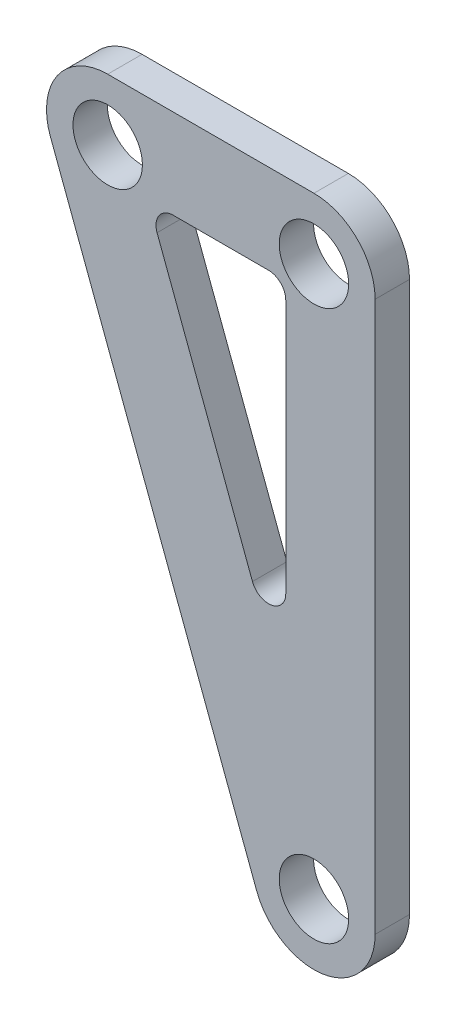
ISO-10303-21;
HEADER;
FILE_DESCRIPTION(('STEP AP214'),'2;1');
FILE_NAME('part.step','',(''),(''),'','','');
FILE_SCHEMA(('AUTOMOTIVE_DESIGN { 1 0 10303 214 1 1 1 1 }'));
ENDSEC;
DATA;
#1=APPLICATION_CONTEXT('core data for automotive mechanical design processes');
#2=APPLICATION_PROTOCOL_DEFINITION('international standard','automotive_design',2000,#1);
#3=PRODUCT_CONTEXT('',#1,'mechanical');
#4=PRODUCT('Part','Part','',(#3));
#5=PRODUCT_RELATED_PRODUCT_CATEGORY('part','',(#4));
#6=PRODUCT_DEFINITION_FORMATION('','',#4);
#7=PRODUCT_DEFINITION_CONTEXT('part definition',#1,'design');
#8=PRODUCT_DEFINITION('design','',#6,#7);
#9=PRODUCT_DEFINITION_SHAPE('','',#8);
#10=(LENGTH_UNIT() NAMED_UNIT(*) SI_UNIT(.MILLI.,.METRE.));
#11=(NAMED_UNIT(*) PLANE_ANGLE_UNIT() SI_UNIT($,.RADIAN.));
#12=(NAMED_UNIT(*) SI_UNIT($,.STERADIAN.) SOLID_ANGLE_UNIT());
#13=UNCERTAINTY_MEASURE_WITH_UNIT(LENGTH_MEASURE(1.E-05),#10,'distance_accuracy_value','');
#14=(GEOMETRIC_REPRESENTATION_CONTEXT(3) GLOBAL_UNCERTAINTY_ASSIGNED_CONTEXT((#13)) GLOBAL_UNIT_ASSIGNED_CONTEXT((#10,
#11,#12)) REPRESENTATION_CONTEXT('',''));
#15=CARTESIAN_POINT('',(0.,0.,0.));
#16=DIRECTION('',(0.,0.,1.));
#17=DIRECTION('',(1.,0.,0.));
#18=AXIS2_PLACEMENT_3D('',#15,#16,#17);
#19=CARTESIAN_POINT('',(0.,0.,6.35));
#20=DIRECTION('',(0.,0.,1.));
#21=DIRECTION('',(1.,0.,0.));
#22=AXIS2_PLACEMENT_3D('',#19,#20,#21);
#23=PLANE('',#22);
#24=CARTESIAN_POINT('',(0.,0.,6.35));
#25=DIRECTION('',(0.,0.,1.));
#26=DIRECTION('',(1.,0.,0.));
#27=AXIS2_PLACEMENT_3D('',#24,#25,#26);
#28=CIRCLE('',#27,6.4135);
#29=CARTESIAN_POINT('',(6.4135,0.,6.35));
#30=VERTEX_POINT('',#29);
#31=EDGE_CURVE('E238',#30,#30,#28,.T.);
#32=ORIENTED_EDGE('',*,*,#31,.F.);
#33=EDGE_LOOP('',(#32));
#34=FACE_BOUND('',#33,.T.);
#35=CARTESIAN_POINT('',(0.,0.,6.35));
#36=DIRECTION('',(0.,0.,1.));
#37=DIRECTION('',(1.,0.,0.));
#38=AXIS2_PLACEMENT_3D('',#35,#36,#37);
#39=CIRCLE('',#38,11.303);
#40=CARTESIAN_POINT('',(0.,11.303,6.35));
#41=VERTEX_POINT('',#40);
#42=CARTESIAN_POINT('',(-10.5833286940629,-3.96874826027359,6.35));
#43=VERTEX_POINT('',#42);
#44=EDGE_CURVE('E145',#41,#43,#39,.T.);
#45=ORIENTED_EDGE('',*,*,#44,.T.);
#46=DIRECTION('',(0.351123441588392,-0.936329177569044,0.));
#47=VECTOR('',#46,1.);
#48=CARTESIAN_POINT('',(-10.5833286940629,-3.96874826027359,6.35));
#49=LINE('',#48,#47);
#50=CARTESIAN_POINT('',(27.5166713059371,-105.568748260274,6.35));
#51=VERTEX_POINT('',#50);
#52=EDGE_CURVE('E133',#43,#51,#49,.T.);
#53=ORIENTED_EDGE('',*,*,#52,.T.);
#54=CARTESIAN_POINT('',(38.1,-101.6,6.35));
#55=DIRECTION('',(0.,0.,1.));
#56=DIRECTION('',(1.,0.,0.));
#57=AXIS2_PLACEMENT_3D('',#54,#55,#56);
#58=CIRCLE('',#57,11.303);
#59=CARTESIAN_POINT('',(49.403,-101.6,6.35));
#60=VERTEX_POINT('',#59);
#61=EDGE_CURVE('E144',#51,#60,#58,.T.);
#62=ORIENTED_EDGE('',*,*,#61,.T.);
#63=DIRECTION('',(0.,1.,0.));
#64=VECTOR('',#63,1.);
#65=CARTESIAN_POINT('',(49.403,0.,6.35));
#66=LINE('',#65,#64);
#67=CARTESIAN_POINT('',(49.403,0.,6.35));
#68=VERTEX_POINT('',#67);
#69=EDGE_CURVE('E249',#60,#68,#66,.T.);
#70=ORIENTED_EDGE('',*,*,#69,.T.);
#71=CARTESIAN_POINT('',(38.1,0.,6.35));
#72=DIRECTION('',(0.,0.,1.));
#73=DIRECTION('',(1.,0.,0.));
#74=AXIS2_PLACEMENT_3D('',#71,#72,#73);
#75=CIRCLE('',#74,11.303);
#76=CARTESIAN_POINT('',(38.1,11.303,6.35));
#77=VERTEX_POINT('',#76);
#78=EDGE_CURVE('E252',#68,#77,#75,.T.);
#79=ORIENTED_EDGE('',*,*,#78,.T.);
#80=DIRECTION('',(-1.,0.,0.));
#81=VECTOR('',#80,1.);
#82=CARTESIAN_POINT('',(0.,11.303,6.35));
#83=LINE('',#82,#81);
#84=EDGE_CURVE('E150',#77,#41,#83,.T.);
#85=ORIENTED_EDGE('',*,*,#84,.T.);
#86=EDGE_LOOP('',(#45,#53,#62,#70,#79,#85));
#87=FACE_BOUND('',#86,.T.);
#88=CARTESIAN_POINT('',(38.1,0.,6.35));
#89=DIRECTION('',(0.,0.,1.));
#90=DIRECTION('',(1.,0.,0.));
#91=AXIS2_PLACEMENT_3D('',#88,#89,#90);
#92=CIRCLE('',#91,6.4135);
#93=CARTESIAN_POINT('',(44.5135,0.,6.35));
#94=VERTEX_POINT('',#93);
#95=EDGE_CURVE('E240',#94,#94,#92,.T.);
#96=ORIENTED_EDGE('',*,*,#95,.F.);
#97=EDGE_LOOP('',(#96));
#98=FACE_BOUND('',#97,.T.);
#99=DIRECTION('',(0.351123441588392,-0.936329177569045,0.));
#100=VECTOR('',#99,1.);
#101=CARTESIAN_POINT('',(7.51370343773356,-5.207,6.35));
#102=LINE('',#101,#100);
#103=CARTESIAN_POINT('',(9.12238478537473,-9.49681692704315,6.35));
#104=VERTEX_POINT('',#103);
#105=CARTESIAN_POINT('',(26.7451548612183,-56.4908704626259,6.35));
#106=VERTEX_POINT('',#105);
#107=EDGE_CURVE('E222',#104,#106,#102,.T.);
#108=ORIENTED_EDGE('',*,*,#107,.F.);
#109=CARTESIAN_POINT('',(12.0952299241565,-8.382,6.35));
#110=DIRECTION('',(0.,0.,1.));
#111=DIRECTION('',(1.,0.,0.));
#112=AXIS2_PLACEMENT_3D('',#109,#110,#111);
#113=CIRCLE('',#112,3.175);
#114=CARTESIAN_POINT('',(12.0952299241565,-5.207,6.35));
#115=VERTEX_POINT('',#114);
#116=EDGE_CURVE('E11',#104,#115,#113,.F.);
#117=ORIENTED_EDGE('',*,*,#116,.T.);
#118=DIRECTION('',(-1.,0.,0.));
#119=VECTOR('',#118,1.);
#120=CARTESIAN_POINT('',(7.51370343773356,-5.207,6.35));
#121=LINE('',#120,#119);
#122=CARTESIAN_POINT('',(29.718,-5.207,6.35));
#123=VERTEX_POINT('',#122);
#124=EDGE_CURVE('E219',#123,#115,#121,.T.);
#125=ORIENTED_EDGE('',*,*,#124,.F.);
#126=CARTESIAN_POINT('',(29.718,-8.382,6.35));
#127=DIRECTION('',(0.,0.,1.));
#128=DIRECTION('',(1.,0.,0.));
#129=AXIS2_PLACEMENT_3D('',#126,#127,#128);
#130=CIRCLE('',#129,3.175);
#131=CARTESIAN_POINT('',(32.893,-8.382,6.35));
#132=VERTEX_POINT('',#131);
#133=EDGE_CURVE('E196',#123,#132,#130,.F.);
#134=ORIENTED_EDGE('',*,*,#133,.T.);
#135=DIRECTION('',(0.,1.,0.));
#136=VECTOR('',#135,1.);
#137=CARTESIAN_POINT('',(32.893,-5.207,6.35));
#138=LINE('',#137,#136);
#139=CARTESIAN_POINT('',(32.893,-55.3760535355828,6.35));
#140=VERTEX_POINT('',#139);
#141=EDGE_CURVE('E226',#140,#132,#138,.T.);
#142=ORIENTED_EDGE('',*,*,#141,.F.);
#143=CARTESIAN_POINT('',(29.718,-55.3760535355828,6.35));
#144=DIRECTION('',(0.,0.,1.));
#145=DIRECTION('',(1.,0.,0.));
#146=AXIS2_PLACEMENT_3D('',#143,#144,#145);
#147=CIRCLE('',#146,3.175);
#148=EDGE_CURVE('E190',#140,#106,#147,.F.);
#149=ORIENTED_EDGE('',*,*,#148,.T.);
#150=EDGE_LOOP('',(#108,#117,#125,#134,#142,#149));
#151=FACE_BOUND('',#150,.T.);
#152=CARTESIAN_POINT('',(38.1,-101.6,6.35));
#153=DIRECTION('',(0.,0.,1.));
#154=DIRECTION('',(1.,0.,0.));
#155=AXIS2_PLACEMENT_3D('',#152,#153,#154);
#156=CIRCLE('',#155,6.4135);
#157=CARTESIAN_POINT('',(44.5135,-101.6,6.35));
#158=VERTEX_POINT('',#157);
#159=EDGE_CURVE('E494',#158,#158,#156,.T.);
#160=ORIENTED_EDGE('',*,*,#159,.F.);
#161=EDGE_LOOP('',(#160));
#162=FACE_BOUND('',#161,.T.);
#163=ADVANCED_FACE('F43',(#34,#87,#98,#151,#162),#23,.T.);
#164=CARTESIAN_POINT('',(0.,0.,0.));
#165=DIRECTION('',(0.,0.,1.));
#166=DIRECTION('',(1.,0.,0.));
#167=AXIS2_PLACEMENT_3D('',#164,#165,#166);
#168=PLANE('',#167);
#169=CARTESIAN_POINT('',(38.1,0.,0.));
#170=DIRECTION('',(0.,0.,1.));
#171=DIRECTION('',(1.,0.,0.));
#172=AXIS2_PLACEMENT_3D('',#169,#170,#171);
#173=CIRCLE('',#172,6.4135);
#174=CARTESIAN_POINT('',(44.5135,0.,0.));
#175=VERTEX_POINT('',#174);
#176=EDGE_CURVE('E236',#175,#175,#173,.T.);
#177=ORIENTED_EDGE('',*,*,#176,.T.);
#178=EDGE_LOOP('',(#177));
#179=FACE_BOUND('',#178,.T.);
#180=CARTESIAN_POINT('',(0.,0.,0.));
#181=DIRECTION('',(0.,0.,1.));
#182=DIRECTION('',(1.,0.,0.));
#183=AXIS2_PLACEMENT_3D('',#180,#181,#182);
#184=CIRCLE('',#183,11.303);
#185=CARTESIAN_POINT('',(0.,11.303,0.));
#186=VERTEX_POINT('',#185);
#187=CARTESIAN_POINT('',(-10.5833286940629,-3.96874826027359,0.));
#188=VERTEX_POINT('',#187);
#189=EDGE_CURVE('E159',#186,#188,#184,.T.);
#190=ORIENTED_EDGE('',*,*,#189,.F.);
#191=DIRECTION('',(-1.,0.,0.));
#192=VECTOR('',#191,1.);
#193=CARTESIAN_POINT('',(0.,11.303,0.));
#194=LINE('',#193,#192);
#195=CARTESIAN_POINT('',(38.1,11.303,0.));
#196=VERTEX_POINT('',#195);
#197=EDGE_CURVE('E155',#196,#186,#194,.T.);
#198=ORIENTED_EDGE('',*,*,#197,.F.);
#199=CARTESIAN_POINT('',(38.1,0.,0.));
#200=DIRECTION('',(0.,0.,1.));
#201=DIRECTION('',(1.,0.,0.));
#202=AXIS2_PLACEMENT_3D('',#199,#200,#201);
#203=CIRCLE('',#202,11.303);
#204=CARTESIAN_POINT('',(49.403,0.,0.));
#205=VERTEX_POINT('',#204);
#206=EDGE_CURVE('E269',#205,#196,#203,.T.);
#207=ORIENTED_EDGE('',*,*,#206,.F.);
#208=DIRECTION('',(0.,1.,0.));
#209=VECTOR('',#208,1.);
#210=CARTESIAN_POINT('',(49.403,0.,0.));
#211=LINE('',#210,#209);
#212=CARTESIAN_POINT('',(49.403,-101.6,0.));
#213=VERTEX_POINT('',#212);
#214=EDGE_CURVE('E266',#213,#205,#211,.T.);
#215=ORIENTED_EDGE('',*,*,#214,.F.);
#216=CARTESIAN_POINT('',(38.1,-101.6,0.));
#217=DIRECTION('',(0.,0.,1.));
#218=DIRECTION('',(1.,0.,0.));
#219=AXIS2_PLACEMENT_3D('',#216,#217,#218);
#220=CIRCLE('',#219,11.303);
#221=CARTESIAN_POINT('',(27.5166713059371,-105.568748260274,0.));
#222=VERTEX_POINT('',#221);
#223=EDGE_CURVE('E263',#222,#213,#220,.T.);
#224=ORIENTED_EDGE('',*,*,#223,.F.);
#225=DIRECTION('',(0.351123441588392,-0.936329177569044,0.));
#226=VECTOR('',#225,1.);
#227=CARTESIAN_POINT('',(-10.5833286940629,-3.96874826027359,0.));
#228=LINE('',#227,#226);
#229=EDGE_CURVE('E260',#188,#222,#228,.T.);
#230=ORIENTED_EDGE('',*,*,#229,.F.);
#231=EDGE_LOOP('',(#190,#198,#207,#215,#224,#230));
#232=FACE_BOUND('',#231,.T.);
#233=DIRECTION('',(0.,1.,0.));
#234=VECTOR('',#233,1.);
#235=CARTESIAN_POINT('',(32.893,-5.207,0.));
#236=LINE('',#235,#234);
#237=CARTESIAN_POINT('',(32.893,-55.3760535355828,0.));
#238=VERTEX_POINT('',#237);
#239=CARTESIAN_POINT('',(32.893,-8.382,0.));
#240=VERTEX_POINT('',#239);
#241=EDGE_CURVE('E216',#238,#240,#236,.T.);
#242=ORIENTED_EDGE('',*,*,#241,.T.);
#243=CARTESIAN_POINT('',(29.718,-8.382,0.));
#244=DIRECTION('',(0.,0.,1.));
#245=DIRECTION('',(1.,0.,0.));
#246=AXIS2_PLACEMENT_3D('',#243,#244,#245);
#247=CIRCLE('',#246,3.175);
#248=CARTESIAN_POINT('',(29.718,-5.207,0.));
#249=VERTEX_POINT('',#248);
#250=EDGE_CURVE('E193',#240,#249,#247,.T.);
#251=ORIENTED_EDGE('',*,*,#250,.T.);
#252=DIRECTION('',(-1.,0.,0.));
#253=VECTOR('',#252,1.);
#254=CARTESIAN_POINT('',(7.51370343773356,-5.207,0.));
#255=LINE('',#254,#253);
#256=CARTESIAN_POINT('',(12.0952299241565,-5.207,0.));
#257=VERTEX_POINT('',#256);
#258=EDGE_CURVE('E207',#249,#257,#255,.T.);
#259=ORIENTED_EDGE('',*,*,#258,.T.);
#260=CARTESIAN_POINT('',(12.0952299241565,-8.382,0.));
#261=DIRECTION('',(0.,0.,1.));
#262=DIRECTION('',(1.,0.,0.));
#263=AXIS2_PLACEMENT_3D('',#260,#261,#262);
#264=CIRCLE('',#263,3.175);
#265=CARTESIAN_POINT('',(9.12238478537473,-9.49681692704315,0.));
#266=VERTEX_POINT('',#265);
#267=EDGE_CURVE('E52',#257,#266,#264,.T.);
#268=ORIENTED_EDGE('',*,*,#267,.T.);
#269=DIRECTION('',(0.351123441588392,-0.936329177569045,0.));
#270=VECTOR('',#269,1.);
#271=CARTESIAN_POINT('',(7.51370343773356,-5.207,0.));
#272=LINE('',#271,#270);
#273=CARTESIAN_POINT('',(26.7451548612183,-56.4908704626259,0.));
#274=VERTEX_POINT('',#273);
#275=EDGE_CURVE('E206',#266,#274,#272,.T.);
#276=ORIENTED_EDGE('',*,*,#275,.T.);
#277=CARTESIAN_POINT('',(29.718,-55.3760535355828,0.));
#278=DIRECTION('',(0.,0.,1.));
#279=DIRECTION('',(1.,0.,0.));
#280=AXIS2_PLACEMENT_3D('',#277,#278,#279);
#281=CIRCLE('',#280,3.175);
#282=EDGE_CURVE('E187',#274,#238,#281,.T.);
#283=ORIENTED_EDGE('',*,*,#282,.T.);
#284=EDGE_LOOP('',(#242,#251,#259,#268,#276,#283));
#285=FACE_BOUND('',#284,.T.);
#286=CARTESIAN_POINT('',(0.,0.,0.));
#287=DIRECTION('',(0.,0.,1.));
#288=DIRECTION('',(1.,0.,0.));
#289=AXIS2_PLACEMENT_3D('',#286,#287,#288);
#290=CIRCLE('',#289,6.4135);
#291=CARTESIAN_POINT('',(6.4135,0.,0.));
#292=VERTEX_POINT('',#291);
#293=EDGE_CURVE('E230',#292,#292,#290,.T.);
#294=ORIENTED_EDGE('',*,*,#293,.T.);
#295=EDGE_LOOP('',(#294));
#296=FACE_BOUND('',#295,.T.);
#297=CARTESIAN_POINT('',(38.1,-101.6,0.));
#298=DIRECTION('',(0.,0.,1.));
#299=DIRECTION('',(1.,0.,0.));
#300=AXIS2_PLACEMENT_3D('',#297,#298,#299);
#301=CIRCLE('',#300,6.4135);
#302=CARTESIAN_POINT('',(44.5135,-101.6,0.));
#303=VERTEX_POINT('',#302);
#304=EDGE_CURVE('E496',#303,#303,#301,.T.);
#305=ORIENTED_EDGE('',*,*,#304,.T.);
#306=EDGE_LOOP('',(#305));
#307=FACE_BOUND('',#306,.T.);
#308=ADVANCED_FACE('F204',(#179,#232,#285,#296,#307),#168,.F.);
#309=CARTESIAN_POINT('',(0.,0.,6.35));
#310=DIRECTION('',(0.,0.,-1.));
#311=DIRECTION('',(-1.,0.,0.));
#312=AXIS2_PLACEMENT_3D('',#309,#310,#311);
#313=CYLINDRICAL_SURFACE('',#312,11.303);
#314=ORIENTED_EDGE('',*,*,#189,.T.);
#315=DIRECTION('',(0.,0.,-1.));
#316=VECTOR('',#315,1.);
#317=CARTESIAN_POINT('',(-10.5833286940629,-3.96874826027359,6.35));
#318=LINE('',#317,#316);
#319=EDGE_CURVE('E137',#43,#188,#318,.T.);
#320=ORIENTED_EDGE('',*,*,#319,.F.);
#321=ORIENTED_EDGE('',*,*,#44,.F.);
#322=DIRECTION('',(0.,0.,-1.));
#323=VECTOR('',#322,1.);
#324=CARTESIAN_POINT('',(0.,11.303,6.35));
#325=LINE('',#324,#323);
#326=EDGE_CURVE('E257',#41,#186,#325,.T.);
#327=ORIENTED_EDGE('',*,*,#326,.T.);
#328=EDGE_LOOP('',(#314,#320,#321,#327));
#329=FACE_BOUND('',#328,.T.);
#330=ADVANCED_FACE('F157',(#329),#313,.T.);
#331=CARTESIAN_POINT('',(-10.5833286940629,-3.96874826027359,6.35));
#332=DIRECTION('',(0.936329177569044,0.351123441588392,0.));
#333=DIRECTION('',(-0.351123441588392,0.936329177569045,0.));
#334=AXIS2_PLACEMENT_3D('',#331,#332,#333);
#335=PLANE('',#334);
#336=ORIENTED_EDGE('',*,*,#229,.T.);
#337=DIRECTION('',(0.,0.,-1.));
#338=VECTOR('',#337,1.);
#339=CARTESIAN_POINT('',(27.5166713059371,-105.568748260274,6.35));
#340=LINE('',#339,#338);
#341=EDGE_CURVE('E140',#51,#222,#340,.T.);
#342=ORIENTED_EDGE('',*,*,#341,.F.);
#343=ORIENTED_EDGE('',*,*,#52,.F.);
#344=ORIENTED_EDGE('',*,*,#319,.T.);
#345=EDGE_LOOP('',(#336,#342,#343,#344));
#346=FACE_BOUND('',#345,.T.);
#347=ADVANCED_FACE('F135',(#346),#335,.F.);
#348=CARTESIAN_POINT('',(38.1,-101.6,6.35));
#349=DIRECTION('',(0.,0.,-1.));
#350=DIRECTION('',(-1.,0.,0.));
#351=AXIS2_PLACEMENT_3D('',#348,#349,#350);
#352=CYLINDRICAL_SURFACE('',#351,11.303);
#353=ORIENTED_EDGE('',*,*,#223,.T.);
#354=DIRECTION('',(0.,0.,-1.));
#355=VECTOR('',#354,1.);
#356=CARTESIAN_POINT('',(49.403,-101.6,6.35));
#357=LINE('',#356,#355);
#358=EDGE_CURVE('E167',#60,#213,#357,.T.);
#359=ORIENTED_EDGE('',*,*,#358,.F.);
#360=ORIENTED_EDGE('',*,*,#61,.F.);
#361=ORIENTED_EDGE('',*,*,#341,.T.);
#362=EDGE_LOOP('',(#353,#359,#360,#361));
#363=FACE_BOUND('',#362,.T.);
#364=ADVANCED_FACE('F302',(#363),#352,.T.);
#365=CARTESIAN_POINT('',(49.403,0.,6.35));
#366=DIRECTION('',(-1.,0.,0.));
#367=DIRECTION('',(0.,-1.,0.));
#368=AXIS2_PLACEMENT_3D('',#365,#366,#367);
#369=PLANE('',#368);
#370=ORIENTED_EDGE('',*,*,#214,.T.);
#371=DIRECTION('',(0.,0.,-1.));
#372=VECTOR('',#371,1.);
#373=CARTESIAN_POINT('',(49.403,0.,6.35));
#374=LINE('',#373,#372);
#375=EDGE_CURVE('E280',#68,#205,#374,.T.);
#376=ORIENTED_EDGE('',*,*,#375,.F.);
#377=ORIENTED_EDGE('',*,*,#69,.F.);
#378=ORIENTED_EDGE('',*,*,#358,.T.);
#379=EDGE_LOOP('',(#370,#376,#377,#378));
#380=FACE_BOUND('',#379,.T.);
#381=ADVANCED_FACE('F289',(#380),#369,.F.);
#382=CARTESIAN_POINT('',(38.1,0.,6.35));
#383=DIRECTION('',(0.,0.,-1.));
#384=DIRECTION('',(-1.,0.,0.));
#385=AXIS2_PLACEMENT_3D('',#382,#383,#384);
#386=CYLINDRICAL_SURFACE('',#385,11.303);
#387=ORIENTED_EDGE('',*,*,#206,.T.);
#388=DIRECTION('',(0.,0.,-1.));
#389=VECTOR('',#388,1.);
#390=CARTESIAN_POINT('',(38.1,11.303,6.35));
#391=LINE('',#390,#389);
#392=EDGE_CURVE('E276',#77,#196,#391,.T.);
#393=ORIENTED_EDGE('',*,*,#392,.F.);
#394=ORIENTED_EDGE('',*,*,#78,.F.);
#395=ORIENTED_EDGE('',*,*,#375,.T.);
#396=EDGE_LOOP('',(#387,#393,#394,#395));
#397=FACE_BOUND('',#396,.T.);
#398=ADVANCED_FACE('F298',(#397),#386,.T.);
#399=CARTESIAN_POINT('',(0.,11.303,6.35));
#400=DIRECTION('',(0.,-1.,0.));
#401=DIRECTION('',(0.,0.,-1.));
#402=AXIS2_PLACEMENT_3D('',#399,#400,#401);
#403=PLANE('',#402);
#404=ORIENTED_EDGE('',*,*,#197,.T.);
#405=ORIENTED_EDGE('',*,*,#326,.F.);
#406=ORIENTED_EDGE('',*,*,#84,.F.);
#407=ORIENTED_EDGE('',*,*,#392,.T.);
#408=EDGE_LOOP('',(#404,#405,#406,#407));
#409=FACE_BOUND('',#408,.T.);
#410=ADVANCED_FACE('F301',(#409),#403,.F.);
#411=CARTESIAN_POINT('',(38.1,0.,6.35));
#412=DIRECTION('',(0.,0.,-1.));
#413=DIRECTION('',(-1.,0.,0.));
#414=AXIS2_PLACEMENT_3D('',#411,#412,#413);
#415=CYLINDRICAL_SURFACE('',#414,6.4135);
#416=ORIENTED_EDGE('',*,*,#95,.T.);
#417=EDGE_LOOP('',(#416));
#418=FACE_BOUND('',#417,.T.);
#419=ORIENTED_EDGE('',*,*,#176,.F.);
#420=EDGE_LOOP('',(#419));
#421=FACE_BOUND('',#420,.T.);
#422=ADVANCED_FACE('F321',(#418,#421),#415,.F.);
#423=CARTESIAN_POINT('',(7.51370343773356,-5.207,6.35));
#424=DIRECTION('',(0.,-1.,0.));
#425=DIRECTION('',(0.,0.,-1.));
#426=AXIS2_PLACEMENT_3D('',#423,#424,#425);
#427=PLANE('',#426);
#428=ORIENTED_EDGE('',*,*,#258,.F.);
#429=DIRECTION('',(0.,0.,-1.));
#430=VECTOR('',#429,1.);
#431=CARTESIAN_POINT('',(29.718,-5.207,6.35));
#432=LINE('',#431,#430);
#433=EDGE_CURVE('E64',#249,#123,#432,.F.);
#434=ORIENTED_EDGE('',*,*,#433,.T.);
#435=ORIENTED_EDGE('',*,*,#124,.T.);
#436=DIRECTION('',(0.,0.,-1.));
#437=VECTOR('',#436,1.);
#438=CARTESIAN_POINT('',(12.0952299241565,-5.207,0.));
#439=LINE('',#438,#437);
#440=EDGE_CURVE('E181',#115,#257,#439,.T.);
#441=ORIENTED_EDGE('',*,*,#440,.T.);
#442=EDGE_LOOP('',(#428,#434,#435,#441));
#443=FACE_BOUND('',#442,.T.);
#444=ADVANCED_FACE('F218',(#443),#427,.T.);
#445=CARTESIAN_POINT('',(7.51370343773356,-5.207,6.35));
#446=DIRECTION('',(0.936329177569044,0.351123441588392,0.));
#447=DIRECTION('',(-0.351123441588392,0.936329177569045,0.));
#448=AXIS2_PLACEMENT_3D('',#445,#446,#447);
#449=PLANE('',#448);
#450=ORIENTED_EDGE('',*,*,#107,.T.);
#451=DIRECTION('',(0.,0.,-1.));
#452=VECTOR('',#451,1.);
#453=CARTESIAN_POINT('',(26.7451548612183,-56.4908704626259,0.));
#454=LINE('',#453,#452);
#455=EDGE_CURVE('E165',#106,#274,#454,.T.);
#456=ORIENTED_EDGE('',*,*,#455,.T.);
#457=ORIENTED_EDGE('',*,*,#275,.F.);
#458=DIRECTION('',(0.,0.,-1.));
#459=VECTOR('',#458,1.);
#460=CARTESIAN_POINT('',(9.12238478537473,-9.49681692704315,6.35));
#461=LINE('',#460,#459);
#462=EDGE_CURVE('E161',#266,#104,#461,.F.);
#463=ORIENTED_EDGE('',*,*,#462,.T.);
#464=EDGE_LOOP('',(#450,#456,#457,#463));
#465=FACE_BOUND('',#464,.T.);
#466=ADVANCED_FACE('F213',(#465),#449,.T.);
#467=CARTESIAN_POINT('',(32.893,-5.207,6.35));
#468=DIRECTION('',(-1.,0.,0.));
#469=DIRECTION('',(0.,0.,1.));
#470=AXIS2_PLACEMENT_3D('',#467,#468,#469);
#471=PLANE('',#470);
#472=ORIENTED_EDGE('',*,*,#241,.F.);
#473=DIRECTION('',(0.,0.,-1.));
#474=VECTOR('',#473,1.);
#475=CARTESIAN_POINT('',(32.893,-55.3760535355828,6.35));
#476=LINE('',#475,#474);
#477=EDGE_CURVE('E178',#238,#140,#476,.F.);
#478=ORIENTED_EDGE('',*,*,#477,.T.);
#479=ORIENTED_EDGE('',*,*,#141,.T.);
#480=DIRECTION('',(0.,0.,-1.));
#481=VECTOR('',#480,1.);
#482=CARTESIAN_POINT('',(32.893,-8.382,0.));
#483=LINE('',#482,#481);
#484=EDGE_CURVE('E174',#132,#240,#483,.T.);
#485=ORIENTED_EDGE('',*,*,#484,.T.);
#486=EDGE_LOOP('',(#472,#478,#479,#485));
#487=FACE_BOUND('',#486,.T.);
#488=ADVANCED_FACE('F354',(#487),#471,.T.);
#489=CARTESIAN_POINT('',(0.,0.,6.35));
#490=DIRECTION('',(0.,0.,-1.));
#491=DIRECTION('',(-1.,0.,0.));
#492=AXIS2_PLACEMENT_3D('',#489,#490,#491);
#493=CYLINDRICAL_SURFACE('',#492,6.4135);
#494=ORIENTED_EDGE('',*,*,#31,.T.);
#495=EDGE_LOOP('',(#494));
#496=FACE_BOUND('',#495,.T.);
#497=ORIENTED_EDGE('',*,*,#293,.F.);
#498=EDGE_LOOP('',(#497));
#499=FACE_BOUND('',#498,.T.);
#500=ADVANCED_FACE('F361',(#496,#499),#493,.F.);
#501=CARTESIAN_POINT('',(38.1,-101.6,6.35));
#502=DIRECTION('',(0.,0.,-1.));
#503=DIRECTION('',(-1.,0.,0.));
#504=AXIS2_PLACEMENT_3D('',#501,#502,#503);
#505=CYLINDRICAL_SURFACE('',#504,6.4135);
#506=ORIENTED_EDGE('',*,*,#159,.T.);
#507=EDGE_LOOP('',(#506));
#508=FACE_BOUND('',#507,.T.);
#509=ORIENTED_EDGE('',*,*,#304,.F.);
#510=EDGE_LOOP('',(#509));
#511=FACE_BOUND('',#510,.T.);
#512=ADVANCED_FACE('F369',(#508,#511),#505,.F.);
#513=CARTESIAN_POINT('',(29.718,-55.3760535355828,6.35));
#514=DIRECTION('',(0.,0.,1.));
#515=DIRECTION('',(1.,0.,0.));
#516=AXIS2_PLACEMENT_3D('',#513,#514,#515);
#517=CYLINDRICAL_SURFACE('',#516,3.175);
#518=ORIENTED_EDGE('',*,*,#148,.F.);
#519=ORIENTED_EDGE('',*,*,#477,.F.);
#520=ORIENTED_EDGE('',*,*,#282,.F.);
#521=ORIENTED_EDGE('',*,*,#455,.F.);
#522=EDGE_LOOP('',(#518,#519,#520,#521));
#523=FACE_BOUND('',#522,.T.);
#524=ADVANCED_FACE('F377',(#523),#517,.F.);
#525=CARTESIAN_POINT('',(29.718,-8.382,6.35));
#526=DIRECTION('',(0.,0.,1.));
#527=DIRECTION('',(1.,0.,0.));
#528=AXIS2_PLACEMENT_3D('',#525,#526,#527);
#529=CYLINDRICAL_SURFACE('',#528,3.175);
#530=ORIENTED_EDGE('',*,*,#133,.F.);
#531=ORIENTED_EDGE('',*,*,#433,.F.);
#532=ORIENTED_EDGE('',*,*,#250,.F.);
#533=ORIENTED_EDGE('',*,*,#484,.F.);
#534=EDGE_LOOP('',(#530,#531,#532,#533));
#535=FACE_BOUND('',#534,.T.);
#536=ADVANCED_FACE('F384',(#535),#529,.F.);
#537=CARTESIAN_POINT('',(12.0952299241565,-8.382,6.35));
#538=DIRECTION('',(0.,0.,1.));
#539=DIRECTION('',(1.,0.,0.));
#540=AXIS2_PLACEMENT_3D('',#537,#538,#539);
#541=CYLINDRICAL_SURFACE('',#540,3.175);
#542=ORIENTED_EDGE('',*,*,#116,.F.);
#543=ORIENTED_EDGE('',*,*,#462,.F.);
#544=ORIENTED_EDGE('',*,*,#267,.F.);
#545=ORIENTED_EDGE('',*,*,#440,.F.);
#546=EDGE_LOOP('',(#542,#543,#544,#545));
#547=FACE_BOUND('',#546,.T.);
#548=ADVANCED_FACE('F45',(#547),#541,.F.);
#549=CLOSED_SHELL('',(#163,#308,#330,#347,#364,#381,#398,#410,#422,#444,#466,#488,#500,#512,
#524,#536,#548));
#550=MANIFOLD_SOLID_BREP('B2',#549);
#551=ADVANCED_BREP_SHAPE_REPRESENTATION('',(#18,#550),#14);
#552=SHAPE_DEFINITION_REPRESENTATION(#9,#551);
ENDSEC;
END-ISO-10303-21;
